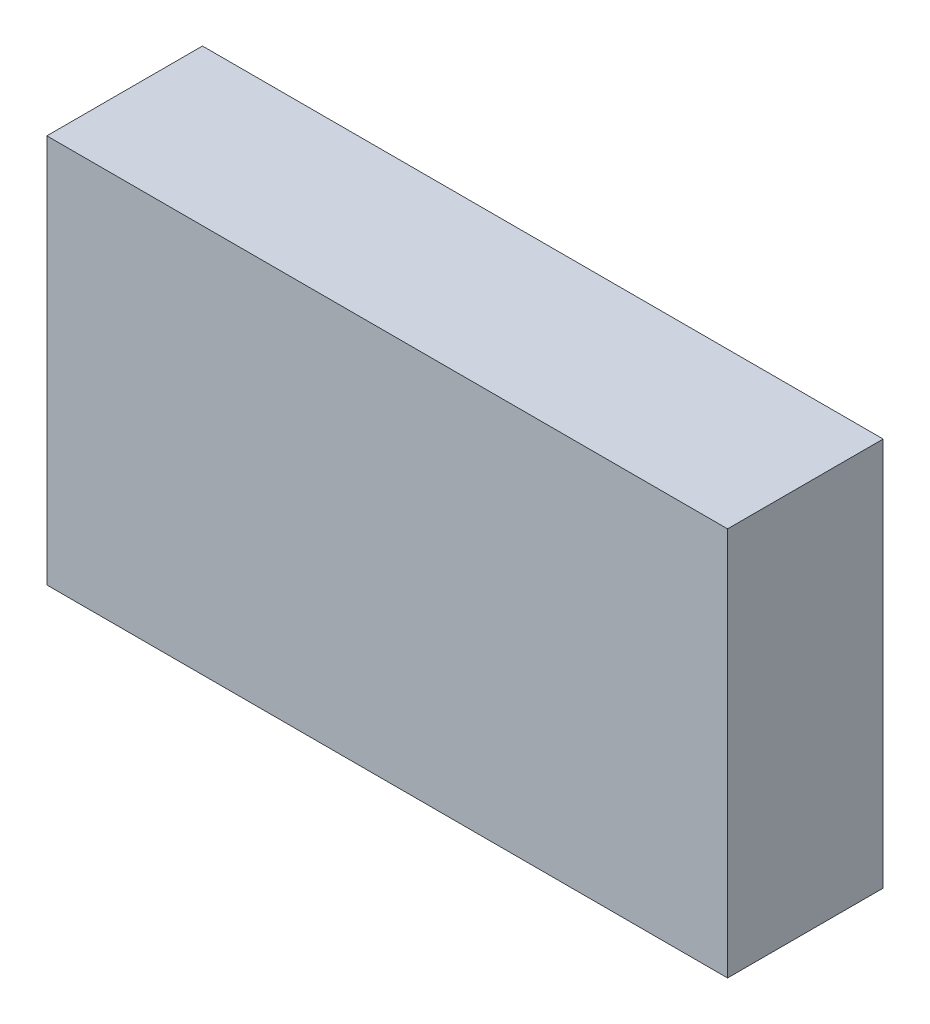
ISO-10303-21;
HEADER;
FILE_DESCRIPTION(('STEP AP214'),'2;1');
FILE_NAME('part.step','',(''),(''),'','','');
FILE_SCHEMA(('AUTOMOTIVE_DESIGN { 1 0 10303 214 1 1 1 1 }'));
ENDSEC;
DATA;
#1=APPLICATION_CONTEXT('core data for automotive mechanical design processes');
#2=APPLICATION_PROTOCOL_DEFINITION('international standard','automotive_design',2000,#1);
#3=PRODUCT_CONTEXT('',#1,'mechanical');
#4=PRODUCT('Part','Part','',(#3));
#5=PRODUCT_RELATED_PRODUCT_CATEGORY('part','',(#4));
#6=PRODUCT_DEFINITION_FORMATION('','',#4);
#7=PRODUCT_DEFINITION_CONTEXT('part definition',#1,'design');
#8=PRODUCT_DEFINITION('design','',#6,#7);
#9=PRODUCT_DEFINITION_SHAPE('','',#8);
#10=(LENGTH_UNIT() NAMED_UNIT(*) SI_UNIT(.MILLI.,.METRE.));
#11=(NAMED_UNIT(*) PLANE_ANGLE_UNIT() SI_UNIT($,.RADIAN.));
#12=(NAMED_UNIT(*) SI_UNIT($,.STERADIAN.) SOLID_ANGLE_UNIT());
#13=UNCERTAINTY_MEASURE_WITH_UNIT(LENGTH_MEASURE(1.E-05),#10,'distance_accuracy_value','');
#14=(GEOMETRIC_REPRESENTATION_CONTEXT(3) GLOBAL_UNCERTAINTY_ASSIGNED_CONTEXT((#13)) GLOBAL_UNIT_ASSIGNED_CONTEXT((#10,
#11,#12)) REPRESENTATION_CONTEXT('',''));
#15=CARTESIAN_POINT('',(0.,0.,0.));
#16=DIRECTION('',(0.,0.,1.));
#17=DIRECTION('',(1.,0.,0.));
#18=AXIS2_PLACEMENT_3D('',#15,#16,#17);
#19=CARTESIAN_POINT('',(17.5,10.,8.));
#20=DIRECTION('',(-1.,0.,0.));
#21=DIRECTION('',(0.,0.,1.));
#22=AXIS2_PLACEMENT_3D('',#19,#20,#21);
#23=PLANE('',#22);
#24=DIRECTION('',(0.,1.,0.));
#25=VECTOR('',#24,1.);
#26=CARTESIAN_POINT('',(17.5,10.,0.));
#27=LINE('',#26,#25);
#28=CARTESIAN_POINT('',(17.5,-10.,0.));
#29=VERTEX_POINT('',#28);
#30=CARTESIAN_POINT('',(17.5,10.,0.));
#31=VERTEX_POINT('',#30);
#32=EDGE_CURVE('E96',#29,#31,#27,.T.);
#33=ORIENTED_EDGE('',*,*,#32,.T.);
#34=DIRECTION('',(0.,0.,-1.));
#35=VECTOR('',#34,1.);
#36=CARTESIAN_POINT('',(17.5,10.,8.));
#37=LINE('',#36,#35);
#38=CARTESIAN_POINT('',(17.5,10.,8.));
#39=VERTEX_POINT('',#38);
#40=EDGE_CURVE('E11',#39,#31,#37,.T.);
#41=ORIENTED_EDGE('',*,*,#40,.F.);
#42=DIRECTION('',(0.,1.,0.));
#43=VECTOR('',#42,1.);
#44=CARTESIAN_POINT('',(17.5,10.,8.));
#45=LINE('',#44,#43);
#46=CARTESIAN_POINT('',(17.5,-10.,8.));
#47=VERTEX_POINT('',#46);
#48=EDGE_CURVE('E84',#47,#39,#45,.T.);
#49=ORIENTED_EDGE('',*,*,#48,.F.);
#50=DIRECTION('',(0.,0.,-1.));
#51=VECTOR('',#50,1.);
#52=CARTESIAN_POINT('',(17.5,-10.,8.));
#53=LINE('',#52,#51);
#54=EDGE_CURVE('E92',#47,#29,#53,.T.);
#55=ORIENTED_EDGE('',*,*,#54,.T.);
#56=EDGE_LOOP('',(#33,#41,#49,#55));
#57=FACE_BOUND('',#56,.T.);
#58=ADVANCED_FACE('F33',(#57),#23,.F.);
#59=CARTESIAN_POINT('',(-17.5,10.,8.));
#60=DIRECTION('',(0.,-1.,0.));
#61=DIRECTION('',(0.,0.,-1.));
#62=AXIS2_PLACEMENT_3D('',#59,#60,#61);
#63=PLANE('',#62);
#64=DIRECTION('',(-1.,0.,0.));
#65=VECTOR('',#64,1.);
#66=CARTESIAN_POINT('',(-17.5,10.,0.));
#67=LINE('',#66,#65);
#68=CARTESIAN_POINT('',(-17.5,10.,0.));
#69=VERTEX_POINT('',#68);
#70=EDGE_CURVE('E88',#31,#69,#67,.T.);
#71=ORIENTED_EDGE('',*,*,#70,.T.);
#72=DIRECTION('',(0.,0.,-1.));
#73=VECTOR('',#72,1.);
#74=CARTESIAN_POINT('',(-17.5,10.,8.));
#75=LINE('',#74,#73);
#76=CARTESIAN_POINT('',(-17.5,10.,8.));
#77=VERTEX_POINT('',#76);
#78=EDGE_CURVE('E41',#77,#69,#75,.T.);
#79=ORIENTED_EDGE('',*,*,#78,.F.);
#80=DIRECTION('',(-1.,0.,0.));
#81=VECTOR('',#80,1.);
#82=CARTESIAN_POINT('',(-17.5,10.,8.));
#83=LINE('',#82,#81);
#84=EDGE_CURVE('E79',#39,#77,#83,.T.);
#85=ORIENTED_EDGE('',*,*,#84,.F.);
#86=ORIENTED_EDGE('',*,*,#40,.T.);
#87=EDGE_LOOP('',(#71,#79,#85,#86));
#88=FACE_BOUND('',#87,.T.);
#89=ADVANCED_FACE('F87',(#88),#63,.F.);
#90=CARTESIAN_POINT('',(-17.5,10.,8.));
#91=DIRECTION('',(1.,0.,0.));
#92=DIRECTION('',(0.,0.,-1.));
#93=AXIS2_PLACEMENT_3D('',#90,#91,#92);
#94=PLANE('',#93);
#95=DIRECTION('',(0.,-1.,0.));
#96=VECTOR('',#95,1.);
#97=CARTESIAN_POINT('',(-17.5,10.,0.));
#98=LINE('',#97,#96);
#99=CARTESIAN_POINT('',(-17.5,-10.,0.));
#100=VERTEX_POINT('',#99);
#101=EDGE_CURVE('E66',#69,#100,#98,.T.);
#102=ORIENTED_EDGE('',*,*,#101,.T.);
#103=DIRECTION('',(0.,0.,-1.));
#104=VECTOR('',#103,1.);
#105=CARTESIAN_POINT('',(-17.5,-10.,8.));
#106=LINE('',#105,#104);
#107=CARTESIAN_POINT('',(-17.5,-10.,8.));
#108=VERTEX_POINT('',#107);
#109=EDGE_CURVE('E89',#108,#100,#106,.T.);
#110=ORIENTED_EDGE('',*,*,#109,.F.);
#111=DIRECTION('',(0.,-1.,0.));
#112=VECTOR('',#111,1.);
#113=CARTESIAN_POINT('',(-17.5,10.,8.));
#114=LINE('',#113,#112);
#115=EDGE_CURVE('E82',#77,#108,#114,.T.);
#116=ORIENTED_EDGE('',*,*,#115,.F.);
#117=ORIENTED_EDGE('',*,*,#78,.T.);
#118=EDGE_LOOP('',(#102,#110,#116,#117));
#119=FACE_BOUND('',#118,.T.);
#120=ADVANCED_FACE('F90',(#119),#94,.F.);
#121=CARTESIAN_POINT('',(-17.5,-10.,8.));
#122=DIRECTION('',(0.,1.,0.));
#123=DIRECTION('',(0.,0.,1.));
#124=AXIS2_PLACEMENT_3D('',#121,#122,#123);
#125=PLANE('',#124);
#126=DIRECTION('',(1.,0.,0.));
#127=VECTOR('',#126,1.);
#128=CARTESIAN_POINT('',(-17.5,-10.,0.));
#129=LINE('',#128,#127);
#130=EDGE_CURVE('E72',#100,#29,#129,.T.);
#131=ORIENTED_EDGE('',*,*,#130,.T.);
#132=ORIENTED_EDGE('',*,*,#54,.F.);
#133=DIRECTION('',(1.,0.,0.));
#134=VECTOR('',#133,1.);
#135=CARTESIAN_POINT('',(-17.5,-10.,8.));
#136=LINE('',#135,#134);
#137=EDGE_CURVE('E49',#108,#47,#136,.T.);
#138=ORIENTED_EDGE('',*,*,#137,.F.);
#139=ORIENTED_EDGE('',*,*,#109,.T.);
#140=EDGE_LOOP('',(#131,#132,#138,#139));
#141=FACE_BOUND('',#140,.T.);
#142=ADVANCED_FACE('F103',(#141),#125,.F.);
#143=CARTESIAN_POINT('',(0.,0.,8.));
#144=DIRECTION('',(0.,0.,1.));
#145=DIRECTION('',(1.,0.,0.));
#146=AXIS2_PLACEMENT_3D('',#143,#144,#145);
#147=PLANE('',#146);
#148=ORIENTED_EDGE('',*,*,#48,.T.);
#149=ORIENTED_EDGE('',*,*,#84,.T.);
#150=ORIENTED_EDGE('',*,*,#115,.T.);
#151=ORIENTED_EDGE('',*,*,#137,.T.);
#152=EDGE_LOOP('',(#148,#149,#150,#151));
#153=FACE_BOUND('',#152,.T.);
#154=ADVANCED_FACE('F80',(#153),#147,.T.);
#155=CARTESIAN_POINT('',(0.,0.,0.));
#156=DIRECTION('',(0.,0.,1.));
#157=DIRECTION('',(1.,0.,0.));
#158=AXIS2_PLACEMENT_3D('',#155,#156,#157);
#159=PLANE('',#158);
#160=ORIENTED_EDGE('',*,*,#32,.F.);
#161=ORIENTED_EDGE('',*,*,#130,.F.);
#162=ORIENTED_EDGE('',*,*,#101,.F.);
#163=ORIENTED_EDGE('',*,*,#70,.F.);
#164=EDGE_LOOP('',(#160,#161,#162,#163));
#165=FACE_BOUND('',#164,.T.);
#166=ADVANCED_FACE('F106',(#165),#159,.F.);
#167=CLOSED_SHELL('',(#58,#89,#120,#142,#154,#166));
#168=MANIFOLD_SOLID_BREP('B2',#167);
#169=ADVANCED_BREP_SHAPE_REPRESENTATION('',(#18,#168),#14);
#170=SHAPE_DEFINITION_REPRESENTATION(#9,#169);
ENDSEC;
END-ISO-10303-21;
